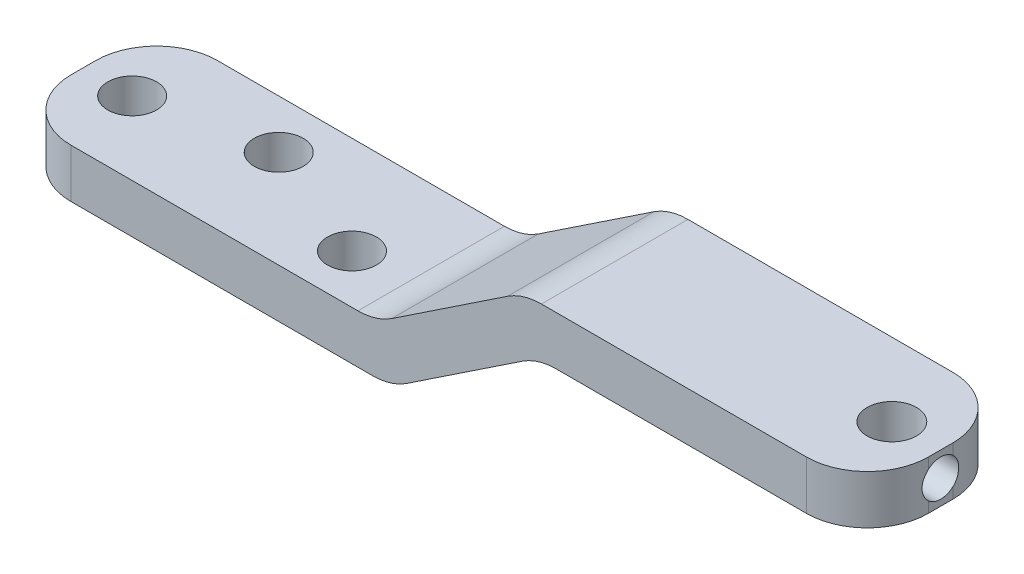
ISO-10303-21;
HEADER;
FILE_DESCRIPTION(('STEP AP214'),'2;1');
FILE_NAME('part.step','',(''),(''),'','','');
FILE_SCHEMA(('AUTOMOTIVE_DESIGN { 1 0 10303 214 1 1 1 1 }'));
ENDSEC;
DATA;
#1=APPLICATION_CONTEXT('core data for automotive mechanical design processes');
#2=APPLICATION_PROTOCOL_DEFINITION('international standard','automotive_design',2000,#1);
#3=PRODUCT_CONTEXT('',#1,'mechanical');
#4=PRODUCT('Part','Part','',(#3));
#5=PRODUCT_RELATED_PRODUCT_CATEGORY('part','',(#4));
#6=PRODUCT_DEFINITION_FORMATION('','',#4);
#7=PRODUCT_DEFINITION_CONTEXT('part definition',#1,'design');
#8=PRODUCT_DEFINITION('design','',#6,#7);
#9=PRODUCT_DEFINITION_SHAPE('','',#8);
#10=(LENGTH_UNIT() NAMED_UNIT(*) SI_UNIT(.MILLI.,.METRE.));
#11=(NAMED_UNIT(*) PLANE_ANGLE_UNIT() SI_UNIT($,.RADIAN.));
#12=(NAMED_UNIT(*) SI_UNIT($,.STERADIAN.) SOLID_ANGLE_UNIT());
#13=UNCERTAINTY_MEASURE_WITH_UNIT(LENGTH_MEASURE(1.E-05),#10,'distance_accuracy_value','');
#14=(GEOMETRIC_REPRESENTATION_CONTEXT(3) GLOBAL_UNCERTAINTY_ASSIGNED_CONTEXT((#13)) GLOBAL_UNIT_ASSIGNED_CONTEXT((#10,
#11,#12)) REPRESENTATION_CONTEXT('',''));
#15=CARTESIAN_POINT('',(0.,0.,0.));
#16=DIRECTION('',(0.,0.,1.));
#17=DIRECTION('',(1.,0.,0.));
#18=AXIS2_PLACEMENT_3D('',#15,#16,#17);
#19=CARTESIAN_POINT('',(4.,4.,6.));
#20=DIRECTION('',(-1.,0.,0.));
#21=DIRECTION('',(0.,0.,1.));
#22=AXIS2_PLACEMENT_3D('',#19,#20,#21);
#23=PLANE('',#22);
#24=DIRECTION('',(0.,1.,0.));
#25=VECTOR('',#24,1.);
#26=CARTESIAN_POINT('',(4.,4.,1.));
#27=LINE('',#26,#25);
#28=CARTESIAN_POINT('',(4.,4.,1.));
#29=VERTEX_POINT('',#28);
#30=CARTESIAN_POINT('',(4.,3.11803398874989,1.));
#31=VERTEX_POINT('',#30);
#32=EDGE_CURVE('E168',#29,#31,#27,.F.);
#33=ORIENTED_EDGE('',*,*,#32,.T.);
#34=CARTESIAN_POINT('',(4.,2.,0.));
#35=DIRECTION('',(1.,0.,0.));
#36=DIRECTION('',(0.,0.,-1.));
#37=AXIS2_PLACEMENT_3D('',#34,#35,#36);
#38=CIRCLE('',#37,1.49999999999999);
#39=CARTESIAN_POINT('',(4.,3.11803398874988,-1.));
#40=VERTEX_POINT('',#39);
#41=EDGE_CURVE('E47',#40,#31,#38,.T.);
#42=ORIENTED_EDGE('',*,*,#41,.F.);
#43=DIRECTION('',(0.,1.,0.));
#44=VECTOR('',#43,1.);
#45=CARTESIAN_POINT('',(4.,4.,-1.));
#46=LINE('',#45,#44);
#47=CARTESIAN_POINT('',(4.,4.,-1.));
#48=VERTEX_POINT('',#47);
#49=EDGE_CURVE('E54',#40,#48,#46,.T.);
#50=ORIENTED_EDGE('',*,*,#49,.T.);
#51=DIRECTION('',(0.,0.,-1.));
#52=VECTOR('',#51,1.);
#53=CARTESIAN_POINT('',(4.,4.,6.));
#54=LINE('',#53,#52);
#55=EDGE_CURVE('E249',#29,#48,#54,.T.);
#56=ORIENTED_EDGE('',*,*,#55,.F.);
#57=EDGE_LOOP('',(#33,#42,#50,#56));
#58=FACE_BOUND('',#57,.T.);
#59=ADVANCED_FACE('F31',(#58),#23,.F.);
#60=CARTESIAN_POINT('',(4.,0.,-1.));
#61=VERTEX_POINT('',#60);
#62=CARTESIAN_POINT('',(4.,0.881966011250122,-1.));
#63=VERTEX_POINT('',#62);
#64=EDGE_CURVE('E175',#61,#63,#46,.T.);
#65=ORIENTED_EDGE('',*,*,#64,.T.);
#66=CARTESIAN_POINT('',(4.,0.881966011250122,1.));
#67=VERTEX_POINT('',#66);
#68=EDGE_CURVE('E159',#67,#63,#38,.T.);
#69=ORIENTED_EDGE('',*,*,#68,.F.);
#70=CARTESIAN_POINT('',(4.,0.,1.));
#71=VERTEX_POINT('',#70);
#72=EDGE_CURVE('E178',#67,#71,#27,.F.);
#73=ORIENTED_EDGE('',*,*,#72,.T.);
#74=DIRECTION('',(0.,0.,-1.));
#75=VECTOR('',#74,1.);
#76=CARTESIAN_POINT('',(4.,0.,6.));
#77=LINE('',#76,#75);
#78=EDGE_CURVE('E232',#71,#61,#77,.T.);
#79=ORIENTED_EDGE('',*,*,#78,.T.);
#80=EDGE_LOOP('',(#65,#69,#73,#79));
#81=FACE_BOUND('',#80,.T.);
#82=ADVANCED_FACE('F231',(#81),#23,.F.);
#83=CARTESIAN_POINT('',(-24.211102550928,4.,6.));
#84=DIRECTION('',(0.,-1.,0.));
#85=DIRECTION('',(1.,0.,0.));
#86=AXIS2_PLACEMENT_3D('',#83,#84,#85);
#87=PLANE('',#86);
#88=CARTESIAN_POINT('',(0.,4.,0.));
#89=DIRECTION('',(0.,1.,0.));
#90=DIRECTION('',(-1.,0.,0.));
#91=AXIS2_PLACEMENT_3D('',#88,#89,#90);
#92=CIRCLE('',#91,2.025);
#93=CARTESIAN_POINT('',(-2.025,4.,0.));
#94=VERTEX_POINT('',#93);
#95=EDGE_CURVE('E358',#94,#94,#92,.T.);
#96=ORIENTED_EDGE('',*,*,#95,.F.);
#97=EDGE_LOOP('',(#96));
#98=FACE_BOUND('',#97,.T.);
#99=DIRECTION('',(-1.,0.,0.));
#100=VECTOR('',#99,1.);
#101=CARTESIAN_POINT('',(-24.211102550928,4.,-6.));
#102=LINE('',#101,#100);
#103=CARTESIAN_POINT('',(-1.,4.,-6.));
#104=VERTEX_POINT('',#103);
#105=CARTESIAN_POINT('',(-22.697224362268,4.,-6.));
#106=VERTEX_POINT('',#105);
#107=EDGE_CURVE('E205',#104,#106,#102,.T.);
#108=ORIENTED_EDGE('',*,*,#107,.T.);
#109=DIRECTION('',(0.,0.,-1.));
#110=VECTOR('',#109,1.);
#111=CARTESIAN_POINT('',(-22.697224362268,4.,6.));
#112=LINE('',#111,#110);
#113=CARTESIAN_POINT('',(-22.697224362268,4.,6.));
#114=VERTEX_POINT('',#113);
#115=EDGE_CURVE('E217',#106,#114,#112,.F.);
#116=ORIENTED_EDGE('',*,*,#115,.T.);
#117=DIRECTION('',(-1.,0.,0.));
#118=VECTOR('',#117,1.);
#119=CARTESIAN_POINT('',(-24.211102550928,4.,6.));
#120=LINE('',#119,#118);
#121=CARTESIAN_POINT('',(-1.,4.,6.));
#122=VERTEX_POINT('',#121);
#123=EDGE_CURVE('E306',#122,#114,#120,.T.);
#124=ORIENTED_EDGE('',*,*,#123,.F.);
#125=CARTESIAN_POINT('',(-1.,4.,1.));
#126=DIRECTION('',(0.,-1.,0.));
#127=DIRECTION('',(1.,0.,0.));
#128=AXIS2_PLACEMENT_3D('',#125,#126,#127);
#129=CIRCLE('',#128,5.);
#130=EDGE_CURVE('E209',#122,#29,#129,.F.);
#131=ORIENTED_EDGE('',*,*,#130,.T.);
#132=ORIENTED_EDGE('',*,*,#55,.T.);
#133=CARTESIAN_POINT('',(-1.,4.,-1.));
#134=DIRECTION('',(0.,-1.,0.));
#135=DIRECTION('',(1.,0.,0.));
#136=AXIS2_PLACEMENT_3D('',#133,#134,#135);
#137=CIRCLE('',#136,5.);
#138=EDGE_CURVE('E173',#48,#104,#137,.F.);
#139=ORIENTED_EDGE('',*,*,#138,.T.);
#140=EDGE_LOOP('',(#108,#116,#124,#131,#132,#139));
#141=FACE_BOUND('',#140,.T.);
#142=ADVANCED_FACE('F351',(#98,#141),#87,.F.);
#143=CARTESIAN_POINT('',(-36.211102550928,-4.00000000000001,6.));
#144=DIRECTION('',(0.554700196225229,-0.832050294337843,0.));
#145=DIRECTION('',(0.832050294337843,0.554700196225229,0.));
#146=AXIS2_PLACEMENT_3D('',#143,#144,#145);
#147=PLANE('',#146);
#148=DIRECTION('',(-0.832050294337843,-0.55470019622523,0.));
#149=VECTOR('',#148,1.);
#150=CARTESIAN_POINT('',(-36.211102550928,-4.00000000000001,-6.));
#151=LINE('',#150,#149);
#152=CARTESIAN_POINT('',(-25.4707253433942,3.16025147168922,-6.));
#153=VERTEX_POINT('',#152);
#154=CARTESIAN_POINT('',(-34.9514797584618,-3.16025147168922,-6.));
#155=VERTEX_POINT('',#154);
#156=EDGE_CURVE('E190',#153,#155,#151,.T.);
#157=ORIENTED_EDGE('',*,*,#156,.T.);
#158=DIRECTION('',(0.,0.,-1.));
#159=VECTOR('',#158,1.);
#160=CARTESIAN_POINT('',(-34.9514797584618,-3.16025147168922,6.));
#161=LINE('',#160,#159);
#162=CARTESIAN_POINT('',(-34.9514797584618,-3.16025147168922,6.));
#163=VERTEX_POINT('',#162);
#164=EDGE_CURVE('E201',#155,#163,#161,.F.);
#165=ORIENTED_EDGE('',*,*,#164,.T.);
#166=DIRECTION('',(-0.832050294337843,-0.55470019622523,0.));
#167=VECTOR('',#166,1.);
#168=CARTESIAN_POINT('',(-36.211102550928,-4.00000000000001,6.));
#169=LINE('',#168,#167);
#170=CARTESIAN_POINT('',(-25.4707253433942,3.16025147168922,6.));
#171=VERTEX_POINT('',#170);
#172=EDGE_CURVE('E301',#171,#163,#169,.T.);
#173=ORIENTED_EDGE('',*,*,#172,.F.);
#174=DIRECTION('',(0.,0.,-1.));
#175=VECTOR('',#174,1.);
#176=CARTESIAN_POINT('',(-25.4707253433942,3.16025147168921,6.));
#177=LINE('',#176,#175);
#178=EDGE_CURVE('E204',#171,#153,#177,.T.);
#179=ORIENTED_EDGE('',*,*,#178,.T.);
#180=EDGE_LOOP('',(#157,#165,#173,#179));
#181=FACE_BOUND('',#180,.T.);
#182=ADVANCED_FACE('F199',(#181),#147,.F.);
#183=CARTESIAN_POINT('',(-66.211102550928,-4.00000000000001,6.));
#184=DIRECTION('',(0.,-1.,0.));
#185=DIRECTION('',(0.,0.,-1.));
#186=AXIS2_PLACEMENT_3D('',#183,#184,#185);
#187=PLANE('',#186);
#188=CARTESIAN_POINT('',(-42.211102550928,-4.00000000000001,2.));
#189=DIRECTION('',(0.,1.,0.));
#190=DIRECTION('',(0.,0.,1.));
#191=AXIS2_PLACEMENT_3D('',#188,#189,#190);
#192=CIRCLE('',#191,2.);
#193=CARTESIAN_POINT('',(-42.211102550928,-4.00000000000001,4.));
#194=VERTEX_POINT('',#193);
#195=EDGE_CURVE('E163',#194,#194,#192,.T.);
#196=ORIENTED_EDGE('',*,*,#195,.F.);
#197=EDGE_LOOP('',(#196));
#198=FACE_BOUND('',#197,.T.);
#199=CARTESIAN_POINT('',(-52.211102550928,-4.00000000000001,-2.));
#200=DIRECTION('',(0.,1.,0.));
#201=DIRECTION('',(0.,0.,1.));
#202=AXIS2_PLACEMENT_3D('',#199,#200,#201);
#203=CIRCLE('',#202,2.);
#204=CARTESIAN_POINT('',(-52.211102550928,-4.00000000000001,0.));
#205=VERTEX_POINT('',#204);
#206=EDGE_CURVE('E368',#205,#205,#203,.T.);
#207=ORIENTED_EDGE('',*,*,#206,.F.);
#208=EDGE_LOOP('',(#207));
#209=FACE_BOUND('',#208,.T.);
#210=CARTESIAN_POINT('',(-62.211102550928,-4.00000000000001,0.));
#211=DIRECTION('',(0.,1.,0.));
#212=DIRECTION('',(0.,0.,1.));
#213=AXIS2_PLACEMENT_3D('',#210,#211,#212);
#214=CIRCLE('',#213,2.);
#215=CARTESIAN_POINT('',(-62.211102550928,-4.00000000000001,2.));
#216=VERTEX_POINT('',#215);
#217=EDGE_CURVE('E362',#216,#216,#214,.T.);
#218=ORIENTED_EDGE('',*,*,#217,.F.);
#219=EDGE_LOOP('',(#218));
#220=FACE_BOUND('',#219,.T.);
#221=DIRECTION('',(-1.,0.,0.));
#222=VECTOR('',#221,1.);
#223=CARTESIAN_POINT('',(-66.211102550928,-4.00000000000001,6.));
#224=LINE('',#223,#222);
#225=CARTESIAN_POINT('',(-37.7249807395879,-4.00000000000001,6.));
#226=VERTEX_POINT('',#225);
#227=CARTESIAN_POINT('',(-61.211102550928,-4.00000000000001,6.));
#228=VERTEX_POINT('',#227);
#229=EDGE_CURVE('E295',#226,#228,#224,.T.);
#230=ORIENTED_EDGE('',*,*,#229,.F.);
#231=DIRECTION('',(0.,0.,-1.));
#232=VECTOR('',#231,1.);
#233=CARTESIAN_POINT('',(-37.7249807395879,-4.00000000000001,-6.));
#234=LINE('',#233,#232);
#235=CARTESIAN_POINT('',(-37.7249807395879,-4.00000000000001,-6.));
#236=VERTEX_POINT('',#235);
#237=EDGE_CURVE('E212',#226,#236,#234,.T.);
#238=ORIENTED_EDGE('',*,*,#237,.T.);
#239=DIRECTION('',(-1.,0.,0.));
#240=VECTOR('',#239,1.);
#241=CARTESIAN_POINT('',(-66.211102550928,-4.00000000000001,-6.));
#242=LINE('',#241,#240);
#243=CARTESIAN_POINT('',(-61.211102550928,-4.00000000000001,-6.));
#244=VERTEX_POINT('',#243);
#245=EDGE_CURVE('E192',#236,#244,#242,.T.);
#246=ORIENTED_EDGE('',*,*,#245,.T.);
#247=CARTESIAN_POINT('',(-61.211102550928,-4.00000000000001,-1.));
#248=DIRECTION('',(0.,-1.,0.));
#249=DIRECTION('',(0.,0.,-1.));
#250=AXIS2_PLACEMENT_3D('',#247,#248,#249);
#251=CIRCLE('',#250,5.);
#252=CARTESIAN_POINT('',(-66.211102550928,-4.00000000000001,-1.));
#253=VERTEX_POINT('',#252);
#254=EDGE_CURVE('E289',#244,#253,#251,.F.);
#255=ORIENTED_EDGE('',*,*,#254,.T.);
#256=DIRECTION('',(0.,0.,-1.));
#257=VECTOR('',#256,1.);
#258=CARTESIAN_POINT('',(-66.211102550928,-4.00000000000001,6.));
#259=LINE('',#258,#257);
#260=CARTESIAN_POINT('',(-66.211102550928,-4.00000000000001,1.));
#261=VERTEX_POINT('',#260);
#262=EDGE_CURVE('E253',#261,#253,#259,.T.);
#263=ORIENTED_EDGE('',*,*,#262,.F.);
#264=CARTESIAN_POINT('',(-61.211102550928,-4.00000000000001,1.));
#265=DIRECTION('',(0.,-1.,0.));
#266=DIRECTION('',(0.,0.,-1.));
#267=AXIS2_PLACEMENT_3D('',#264,#265,#266);
#268=CIRCLE('',#267,5.);
#269=EDGE_CURVE('E287',#261,#228,#268,.F.);
#270=ORIENTED_EDGE('',*,*,#269,.T.);
#271=EDGE_LOOP('',(#230,#238,#246,#255,#263,#270));
#272=FACE_BOUND('',#271,.T.);
#273=ADVANCED_FACE('F292',(#198,#209,#220,#272),#187,.F.);
#274=CARTESIAN_POINT('',(-66.211102550928,-8.00000000000001,6.));
#275=DIRECTION('',(1.,0.,0.));
#276=DIRECTION('',(0.,0.,-1.));
#277=AXIS2_PLACEMENT_3D('',#274,#275,#276);
#278=PLANE('',#277);
#279=ORIENTED_EDGE('',*,*,#262,.T.);
#280=DIRECTION('',(0.,-1.,0.));
#281=VECTOR('',#280,1.);
#282=CARTESIAN_POINT('',(-66.211102550928,-8.00000000000001,-1.));
#283=LINE('',#282,#281);
#284=CARTESIAN_POINT('',(-66.211102550928,-8.00000000000001,-1.));
#285=VERTEX_POINT('',#284);
#286=EDGE_CURVE('E220',#253,#285,#283,.T.);
#287=ORIENTED_EDGE('',*,*,#286,.T.);
#288=DIRECTION('',(0.,0.,-1.));
#289=VECTOR('',#288,1.);
#290=CARTESIAN_POINT('',(-66.211102550928,-8.00000000000001,6.));
#291=LINE('',#290,#289);
#292=CARTESIAN_POINT('',(-66.211102550928,-8.00000000000001,1.));
#293=VERTEX_POINT('',#292);
#294=EDGE_CURVE('E243',#293,#285,#291,.T.);
#295=ORIENTED_EDGE('',*,*,#294,.F.);
#296=DIRECTION('',(0.,-1.,0.));
#297=VECTOR('',#296,1.);
#298=CARTESIAN_POINT('',(-66.211102550928,-8.00000000000001,1.));
#299=LINE('',#298,#297);
#300=EDGE_CURVE('E219',#293,#261,#299,.F.);
#301=ORIENTED_EDGE('',*,*,#300,.T.);
#302=EDGE_LOOP('',(#279,#287,#295,#301));
#303=FACE_BOUND('',#302,.T.);
#304=ADVANCED_FACE('F325',(#303),#278,.F.);
#305=CARTESIAN_POINT('',(-35.,-8.00000000000001,6.));
#306=DIRECTION('',(0.,1.,0.));
#307=DIRECTION('',(-1.,0.,0.));
#308=AXIS2_PLACEMENT_3D('',#305,#306,#307);
#309=PLANE('',#308);
#310=CARTESIAN_POINT('',(-42.211102550928,-8.00000000000001,2.));
#311=DIRECTION('',(0.,1.,0.));
#312=DIRECTION('',(0.,0.,1.));
#313=AXIS2_PLACEMENT_3D('',#310,#311,#312);
#314=CIRCLE('',#313,2.);
#315=CARTESIAN_POINT('',(-42.211102550928,-8.00000000000001,4.));
#316=VERTEX_POINT('',#315);
#317=EDGE_CURVE('E371',#316,#316,#314,.T.);
#318=ORIENTED_EDGE('',*,*,#317,.T.);
#319=EDGE_LOOP('',(#318));
#320=FACE_BOUND('',#319,.T.);
#321=CARTESIAN_POINT('',(-52.211102550928,-8.00000000000001,-2.));
#322=DIRECTION('',(0.,1.,0.));
#323=DIRECTION('',(0.,0.,1.));
#324=AXIS2_PLACEMENT_3D('',#321,#322,#323);
#325=CIRCLE('',#324,2.);
#326=CARTESIAN_POINT('',(-52.211102550928,-8.00000000000001,0.));
#327=VERTEX_POINT('',#326);
#328=EDGE_CURVE('E365',#327,#327,#325,.T.);
#329=ORIENTED_EDGE('',*,*,#328,.T.);
#330=EDGE_LOOP('',(#329));
#331=FACE_BOUND('',#330,.T.);
#332=CARTESIAN_POINT('',(-62.211102550928,-8.00000000000001,0.));
#333=DIRECTION('',(0.,1.,0.));
#334=DIRECTION('',(0.,0.,1.));
#335=AXIS2_PLACEMENT_3D('',#332,#333,#334);
#336=CIRCLE('',#335,2.);
#337=CARTESIAN_POINT('',(-62.211102550928,-8.00000000000001,2.));
#338=VERTEX_POINT('',#337);
#339=EDGE_CURVE('E361',#338,#338,#336,.T.);
#340=ORIENTED_EDGE('',*,*,#339,.T.);
#341=EDGE_LOOP('',(#340));
#342=FACE_BOUND('',#341,.T.);
#343=DIRECTION('',(1.,0.,0.));
#344=VECTOR('',#343,1.);
#345=CARTESIAN_POINT('',(-35.,-8.00000000000001,-6.));
#346=LINE('',#345,#344);
#347=CARTESIAN_POINT('',(-61.211102550928,-8.00000000000001,-6.));
#348=VERTEX_POINT('',#347);
#349=CARTESIAN_POINT('',(-36.51387818866,-8.00000000000001,-6.));
#350=VERTEX_POINT('',#349);
#351=EDGE_CURVE('E316',#348,#350,#346,.T.);
#352=ORIENTED_EDGE('',*,*,#351,.T.);
#353=DIRECTION('',(0.,0.,-1.));
#354=VECTOR('',#353,1.);
#355=CARTESIAN_POINT('',(-36.51387818866,-8.00000000000001,6.));
#356=LINE('',#355,#354);
#357=CARTESIAN_POINT('',(-36.51387818866,-8.00000000000001,6.));
#358=VERTEX_POINT('',#357);
#359=EDGE_CURVE('E277',#350,#358,#356,.F.);
#360=ORIENTED_EDGE('',*,*,#359,.T.);
#361=DIRECTION('',(1.,0.,0.));
#362=VECTOR('',#361,1.);
#363=CARTESIAN_POINT('',(-35.,-8.00000000000001,6.));
#364=LINE('',#363,#362);
#365=CARTESIAN_POINT('',(-61.211102550928,-8.00000000000001,6.));
#366=VERTEX_POINT('',#365);
#367=EDGE_CURVE('E300',#366,#358,#364,.T.);
#368=ORIENTED_EDGE('',*,*,#367,.F.);
#369=CARTESIAN_POINT('',(-61.211102550928,-8.00000000000001,1.));
#370=DIRECTION('',(0.,1.,0.));
#371=DIRECTION('',(-1.,0.,0.));
#372=AXIS2_PLACEMENT_3D('',#369,#370,#371);
#373=CIRCLE('',#372,5.);
#374=EDGE_CURVE('E273',#366,#293,#373,.F.);
#375=ORIENTED_EDGE('',*,*,#374,.T.);
#376=ORIENTED_EDGE('',*,*,#294,.T.);
#377=CARTESIAN_POINT('',(-61.211102550928,-8.00000000000001,-1.));
#378=DIRECTION('',(0.,1.,0.));
#379=DIRECTION('',(-1.,0.,0.));
#380=AXIS2_PLACEMENT_3D('',#377,#378,#379);
#381=CIRCLE('',#380,5.);
#382=EDGE_CURVE('E275',#285,#348,#381,.F.);
#383=ORIENTED_EDGE('',*,*,#382,.T.);
#384=EDGE_LOOP('',(#352,#360,#368,#375,#376,#383));
#385=FACE_BOUND('',#384,.T.);
#386=ADVANCED_FACE('F332',(#320,#331,#342,#385),#309,.F.);
#387=CARTESIAN_POINT('',(-23.,0.,6.));
#388=DIRECTION('',(-0.55470019622523,0.832050294337843,0.));
#389=DIRECTION('',(-0.832050294337843,-0.55470019622523,0.));
#390=AXIS2_PLACEMENT_3D('',#387,#388,#389);
#391=PLANE('',#390);
#392=DIRECTION('',(0.832050294337843,0.55470019622523,0.));
#393=VECTOR('',#392,1.);
#394=CARTESIAN_POINT('',(-23.,0.,-6.));
#395=LINE('',#394,#393);
#396=CARTESIAN_POINT('',(-33.7403772075338,-7.16025147168922,-6.));
#397=VERTEX_POINT('',#396);
#398=CARTESIAN_POINT('',(-24.2596227924662,-0.839748528310786,-6.));
#399=VERTEX_POINT('',#398);
#400=EDGE_CURVE('E319',#397,#399,#395,.T.);
#401=ORIENTED_EDGE('',*,*,#400,.T.);
#402=DIRECTION('',(0.,0.,-1.));
#403=VECTOR('',#402,1.);
#404=CARTESIAN_POINT('',(-24.2596227924662,-0.839748528310786,6.));
#405=LINE('',#404,#403);
#406=CARTESIAN_POINT('',(-24.2596227924662,-0.839748528310786,6.));
#407=VERTEX_POINT('',#406);
#408=EDGE_CURVE('E263',#399,#407,#405,.F.);
#409=ORIENTED_EDGE('',*,*,#408,.T.);
#410=DIRECTION('',(0.832050294337843,0.55470019622523,0.));
#411=VECTOR('',#410,1.);
#412=CARTESIAN_POINT('',(-23.,0.,6.));
#413=LINE('',#412,#411);
#414=CARTESIAN_POINT('',(-33.7403772075338,-7.16025147168922,6.));
#415=VERTEX_POINT('',#414);
#416=EDGE_CURVE('E304',#415,#407,#413,.T.);
#417=ORIENTED_EDGE('',*,*,#416,.F.);
#418=DIRECTION('',(0.,0.,-1.));
#419=VECTOR('',#418,1.);
#420=CARTESIAN_POINT('',(-33.7403772075338,-7.16025147168922,6.));
#421=LINE('',#420,#419);
#422=EDGE_CURVE('E260',#415,#397,#421,.T.);
#423=ORIENTED_EDGE('',*,*,#422,.T.);
#424=EDGE_LOOP('',(#401,#409,#417,#423));
#425=FACE_BOUND('',#424,.T.);
#426=ADVANCED_FACE('F340',(#425),#391,.F.);
#427=CARTESIAN_POINT('',(4.,0.,6.));
#428=DIRECTION('',(0.,1.,0.));
#429=DIRECTION('',(-1.,0.,0.));
#430=AXIS2_PLACEMENT_3D('',#427,#428,#429);
#431=PLANE('',#430);
#432=CARTESIAN_POINT('',(0.,0.,0.));
#433=DIRECTION('',(0.,1.,0.));
#434=DIRECTION('',(-1.,0.,0.));
#435=AXIS2_PLACEMENT_3D('',#432,#433,#434);
#436=CIRCLE('',#435,2.025);
#437=CARTESIAN_POINT('',(-2.025,0.,0.));
#438=VERTEX_POINT('',#437);
#439=EDGE_CURVE('E256',#438,#438,#436,.T.);
#440=ORIENTED_EDGE('',*,*,#439,.T.);
#441=EDGE_LOOP('',(#440));
#442=FACE_BOUND('',#441,.T.);
#443=DIRECTION('',(1.,0.,0.));
#444=VECTOR('',#443,1.);
#445=CARTESIAN_POINT('',(4.,0.,6.));
#446=LINE('',#445,#444);
#447=CARTESIAN_POINT('',(-21.48612181134,0.,6.));
#448=VERTEX_POINT('',#447);
#449=CARTESIAN_POINT('',(-1.,0.,6.));
#450=VERTEX_POINT('',#449);
#451=EDGE_CURVE('E244',#448,#450,#446,.T.);
#452=ORIENTED_EDGE('',*,*,#451,.F.);
#453=DIRECTION('',(0.,0.,-1.));
#454=VECTOR('',#453,1.);
#455=CARTESIAN_POINT('',(-21.48612181134,0.,-6.));
#456=LINE('',#455,#454);
#457=CARTESIAN_POINT('',(-21.48612181134,0.,-6.));
#458=VERTEX_POINT('',#457);
#459=EDGE_CURVE('E251',#448,#458,#456,.T.);
#460=ORIENTED_EDGE('',*,*,#459,.T.);
#461=DIRECTION('',(1.,0.,0.));
#462=VECTOR('',#461,1.);
#463=CARTESIAN_POINT('',(4.,0.,-6.));
#464=LINE('',#463,#462);
#465=CARTESIAN_POINT('',(-1.,0.,-6.));
#466=VERTEX_POINT('',#465);
#467=EDGE_CURVE('E322',#458,#466,#464,.T.);
#468=ORIENTED_EDGE('',*,*,#467,.T.);
#469=CARTESIAN_POINT('',(-1.,0.,-1.));
#470=DIRECTION('',(0.,1.,0.));
#471=DIRECTION('',(-1.,0.,0.));
#472=AXIS2_PLACEMENT_3D('',#469,#470,#471);
#473=CIRCLE('',#472,5.);
#474=EDGE_CURVE('E242',#466,#61,#473,.F.);
#475=ORIENTED_EDGE('',*,*,#474,.T.);
#476=ORIENTED_EDGE('',*,*,#78,.F.);
#477=CARTESIAN_POINT('',(-1.,0.,1.));
#478=DIRECTION('',(0.,1.,0.));
#479=DIRECTION('',(-1.,0.,0.));
#480=AXIS2_PLACEMENT_3D('',#477,#478,#479);
#481=CIRCLE('',#480,5.);
#482=EDGE_CURVE('E238',#71,#450,#481,.F.);
#483=ORIENTED_EDGE('',*,*,#482,.T.);
#484=EDGE_LOOP('',(#452,#460,#468,#475,#476,#483));
#485=FACE_BOUND('',#484,.T.);
#486=ADVANCED_FACE('F237',(#442,#485),#431,.F.);
#487=CARTESIAN_POINT('',(4.,0.,6.));
#488=DIRECTION('',(0.,0.,-1.));
#489=DIRECTION('',(-1.,0.,0.));
#490=AXIS2_PLACEMENT_3D('',#487,#488,#489);
#491=PLANE('',#490);
#492=ORIENTED_EDGE('',*,*,#367,.T.);
#493=CARTESIAN_POINT('',(-36.51387818866,-3.00000000000001,6.));
#494=DIRECTION('',(0.,0.,-1.));
#495=DIRECTION('',(-1.,0.,0.));
#496=AXIS2_PLACEMENT_3D('',#493,#494,#495);
#497=CIRCLE('',#496,5.);
#498=EDGE_CURVE('E285',#358,#415,#497,.F.);
#499=ORIENTED_EDGE('',*,*,#498,.T.);
#500=ORIENTED_EDGE('',*,*,#416,.T.);
#501=CARTESIAN_POINT('',(-21.48612181134,-5.,6.));
#502=DIRECTION('',(0.,0.,-1.));
#503=DIRECTION('',(-1.,0.,0.));
#504=AXIS2_PLACEMENT_3D('',#501,#502,#503);
#505=CIRCLE('',#504,5.);
#506=EDGE_CURVE('E183',#407,#448,#505,.T.);
#507=ORIENTED_EDGE('',*,*,#506,.T.);
#508=ORIENTED_EDGE('',*,*,#451,.T.);
#509=DIRECTION('',(0.,1.,0.));
#510=VECTOR('',#509,1.);
#511=CARTESIAN_POINT('',(-1.,0.,6.));
#512=LINE('',#511,#510);
#513=EDGE_CURVE('E248',#450,#122,#512,.T.);
#514=ORIENTED_EDGE('',*,*,#513,.T.);
#515=ORIENTED_EDGE('',*,*,#123,.T.);
#516=CARTESIAN_POINT('',(-22.697224362268,-1.,6.));
#517=DIRECTION('',(0.,0.,-1.));
#518=DIRECTION('',(-1.,0.,0.));
#519=AXIS2_PLACEMENT_3D('',#516,#517,#518);
#520=CIRCLE('',#519,5.);
#521=EDGE_CURVE('E283',#114,#171,#520,.F.);
#522=ORIENTED_EDGE('',*,*,#521,.T.);
#523=ORIENTED_EDGE('',*,*,#172,.T.);
#524=CARTESIAN_POINT('',(-37.7249807395879,0.99999999999999,6.));
#525=DIRECTION('',(0.,0.,-1.));
#526=DIRECTION('',(-1.,0.,0.));
#527=AXIS2_PLACEMENT_3D('',#524,#525,#526);
#528=CIRCLE('',#527,5.);
#529=EDGE_CURVE('E11',#163,#226,#528,.T.);
#530=ORIENTED_EDGE('',*,*,#529,.T.);
#531=ORIENTED_EDGE('',*,*,#229,.T.);
#532=DIRECTION('',(0.,-1.,0.));
#533=VECTOR('',#532,1.);
#534=CARTESIAN_POINT('',(-61.211102550928,0.,6.));
#535=LINE('',#534,#533);
#536=EDGE_CURVE('E280',#228,#366,#535,.T.);
#537=ORIENTED_EDGE('',*,*,#536,.T.);
#538=EDGE_LOOP('',(#492,#499,#500,#507,#508,#514,#515,#522,#523,#530,#531,#537));
#539=FACE_BOUND('',#538,.T.);
#540=ADVANCED_FACE('F343',(#539),#491,.F.);
#541=CARTESIAN_POINT('',(4.,0.,-6.));
#542=DIRECTION('',(0.,0.,-1.));
#543=DIRECTION('',(-1.,0.,0.));
#544=AXIS2_PLACEMENT_3D('',#541,#542,#543);
#545=PLANE('',#544);
#546=ORIENTED_EDGE('',*,*,#400,.F.);
#547=CARTESIAN_POINT('',(-36.51387818866,-3.00000000000001,-6.));
#548=DIRECTION('',(0.,0.,-1.));
#549=DIRECTION('',(-1.,0.,0.));
#550=AXIS2_PLACEMENT_3D('',#547,#548,#549);
#551=CIRCLE('',#550,5.);
#552=EDGE_CURVE('E271',#397,#350,#551,.T.);
#553=ORIENTED_EDGE('',*,*,#552,.T.);
#554=ORIENTED_EDGE('',*,*,#351,.F.);
#555=DIRECTION('',(0.,-1.,0.));
#556=VECTOR('',#555,1.);
#557=CARTESIAN_POINT('',(-61.211102550928,-4.00000000000001,-6.));
#558=LINE('',#557,#556);
#559=EDGE_CURVE('E267',#348,#244,#558,.F.);
#560=ORIENTED_EDGE('',*,*,#559,.T.);
#561=ORIENTED_EDGE('',*,*,#245,.F.);
#562=CARTESIAN_POINT('',(-37.7249807395879,0.99999999999999,-6.));
#563=DIRECTION('',(0.,0.,-1.));
#564=DIRECTION('',(-1.,0.,0.));
#565=AXIS2_PLACEMENT_3D('',#562,#563,#564);
#566=CIRCLE('',#565,5.);
#567=EDGE_CURVE('E40',#236,#155,#566,.F.);
#568=ORIENTED_EDGE('',*,*,#567,.T.);
#569=ORIENTED_EDGE('',*,*,#156,.F.);
#570=CARTESIAN_POINT('',(-22.697224362268,-1.,-6.));
#571=DIRECTION('',(0.,0.,-1.));
#572=DIRECTION('',(-1.,0.,0.));
#573=AXIS2_PLACEMENT_3D('',#570,#571,#572);
#574=CIRCLE('',#573,5.);
#575=EDGE_CURVE('E269',#153,#106,#574,.T.);
#576=ORIENTED_EDGE('',*,*,#575,.T.);
#577=ORIENTED_EDGE('',*,*,#107,.F.);
#578=DIRECTION('',(0.,1.,0.));
#579=VECTOR('',#578,1.);
#580=CARTESIAN_POINT('',(-1.,0.,-6.));
#581=LINE('',#580,#579);
#582=EDGE_CURVE('E265',#104,#466,#581,.F.);
#583=ORIENTED_EDGE('',*,*,#582,.T.);
#584=ORIENTED_EDGE('',*,*,#467,.F.);
#585=CARTESIAN_POINT('',(-21.48612181134,-5.,-6.));
#586=DIRECTION('',(0.,0.,-1.));
#587=DIRECTION('',(-1.,0.,0.));
#588=AXIS2_PLACEMENT_3D('',#585,#586,#587);
#589=CIRCLE('',#588,5.);
#590=EDGE_CURVE('E177',#458,#399,#589,.F.);
#591=ORIENTED_EDGE('',*,*,#590,.T.);
#592=EDGE_LOOP('',(#546,#553,#554,#560,#561,#568,#569,#576,#577,#583,#584,#591));
#593=FACE_BOUND('',#592,.T.);
#594=ADVANCED_FACE('F189',(#593),#545,.T.);
#595=CARTESIAN_POINT('',(0.,-8.00000000000001,0.));
#596=DIRECTION('',(0.,1.,0.));
#597=DIRECTION('',(-1.,0.,0.));
#598=AXIS2_PLACEMENT_3D('',#595,#596,#597);
#599=CYLINDRICAL_SURFACE('',#598,2.025);
#600=CARTESIAN_POINT('',(1.36037678604129,2.,-1.49999999999999));
#601=CARTESIAN_POINT('',(1.36038944530825,2.07038824511991,-1.49999379904754));
#602=CARTESIAN_POINT('',(1.36596432702745,2.14081299106828,-1.49498917127013));
#603=CARTESIAN_POINT('',(1.38696918828383,2.27888123183427,-1.4755085887214));
#604=CARTESIAN_POINT('',(1.40242649228251,2.34651646007039,-1.46100637081657));
#605=CARTESIAN_POINT('',(1.44005251372399,2.47639735863413,-1.42392229819442));
#606=CARTESIAN_POINT('',(1.4621299977991,2.53870236076068,-1.40144956143932));
#607=CARTESIAN_POINT('',(1.51035888707434,2.65845684764736,-1.34933393226198));
#608=CARTESIAN_POINT('',(1.53650998535711,2.71590669770548,-1.31969157992549));
#609=CARTESIAN_POINT('',(1.59622589708248,2.83703567714187,-1.24712342813861));
#610=CARTESIAN_POINT('',(1.63021957289791,2.89962012988126,-1.20272322965181));
#611=CARTESIAN_POINT('',(1.69809014871241,3.0174467912118,-1.10484137973255));
#612=CARTESIAN_POINT('',(1.73196681077571,3.07267832211205,-1.05134677273322));
#613=CARTESIAN_POINT('',(1.80355689286804,3.18508355052084,-0.924189205094365));
#614=CARTESIAN_POINT('',(1.84071392155468,3.2405015574419,-0.848628916885063));
#615=CARTESIAN_POINT('',(1.90727870708111,3.33727825823982,-0.68598877574854));
#616=CARTESIAN_POINT('',(1.9367041077166,3.37866902639864,-0.598935844204278));
#617=CARTESIAN_POINT('',(1.97710504970581,3.43477244735116,-0.442872857328313));
#618=CARTESIAN_POINT('',(1.99096304130937,3.45375412682516,-0.376131046933187));
#619=CARTESIAN_POINT('',(2.01194925247983,3.48236692438581,-0.23965559974545));
#620=CARTESIAN_POINT('',(2.01908323488924,3.49200604975187,-0.1699245785632));
#621=CARTESIAN_POINT('',(2.02601591982054,3.50137450929699,-0.0292558921582485));
#622=CARTESIAN_POINT('',(2.02579650030971,3.50107936102686,0.0416843234151822));
#623=CARTESIAN_POINT('',(2.01799869899551,3.49053886555872,0.182414733573472));
#624=CARTESIAN_POINT('',(2.01041853380994,3.48029110701417,0.252204645292131));
#625=CARTESIAN_POINT('',(1.98891178118915,3.45094466434072,0.386435696193786));
#626=CARTESIAN_POINT('',(1.97519647696054,3.43214030972219,0.450976587194177));
#627=CARTESIAN_POINT('',(1.94248960606617,3.38668289242606,0.575783246980377));
#628=CARTESIAN_POINT('',(1.92349692090558,3.36002816585878,0.636048106095788));
#629=CARTESIAN_POINT('',(1.87911063715023,3.29653544666268,0.75776711520135));
#630=CARTESIAN_POINT('',(1.85324431151957,3.25890284743252,0.818631284517068));
#631=CARTESIAN_POINT('',(1.79814561982182,3.17628676136005,0.933467908638078));
#632=CARTESIAN_POINT('',(1.76891023182202,3.13129665969511,0.987434083234539));
#633=CARTESIAN_POINT('',(1.70297225856939,3.02544297044188,1.09790981081785));
#634=CARTESIAN_POINT('',(1.66592083455234,2.9631929681877,1.1528841090154));
#635=CARTESIAN_POINT('',(1.59268486636908,2.83013107445409,1.25210838179919));
#636=CARTESIAN_POINT('',(1.55650062205793,2.75931627117554,1.29635469371435));
#637=CARTESIAN_POINT('',(1.4960930228035,2.624888433452,1.36527651599803));
#638=CARTESIAN_POINT('',(1.47094197834807,2.56280243019364,1.39210630759751));
#639=CARTESIAN_POINT('',(1.42656768879547,2.43372272267207,1.43754697663581));
#640=CARTESIAN_POINT('',(1.40733107918752,2.36674051274402,1.45617642569447));
#641=CARTESIAN_POINT('',(1.3805653974564,2.24155485330744,1.48153437413789));
#642=CARTESIAN_POINT('',(1.37153523093134,2.18399764877003,1.48981994843688));
#643=CARTESIAN_POINT('',(1.36083143241841,2.06765213499281,1.49960682027497));
#644=CARTESIAN_POINT('',(1.35914973577269,2.00886524654002,1.50111555518069));
#645=CARTESIAN_POINT('',(1.36341533120673,1.89183449694469,1.49724057073329));
#646=CARTESIAN_POINT('',(1.36936007701128,1.83359046109602,1.49185915182851));
#647=CARTESIAN_POINT('',(1.38791317084167,1.71913354297548,1.47461084109594));
#648=CARTESIAN_POINT('',(1.40053235721519,1.66292412371568,1.46273339957474));
#649=CARTESIAN_POINT('',(1.43667970883759,1.53228033693765,1.427385977138));
#650=CARTESIAN_POINT('',(1.46254084490006,1.4592373584032,1.40120610506819));
#651=CARTESIAN_POINT('',(1.51964626544024,1.31972207900947,1.33906031222062));
#652=CARTESIAN_POINT('',(1.55090137122113,1.25326341773674,1.3030746334963));
#653=CARTESIAN_POINT('',(1.61650668083987,1.12501636269836,1.22081709891347));
#654=CARTESIAN_POINT('',(1.65092552387788,1.06345927490437,1.17424080911628));
#655=CARTESIAN_POINT('',(1.71905570553441,0.948005210393325,1.07202865633061));
#656=CARTESIAN_POINT('',(1.75276743481443,0.894103903690576,1.01639795288861));
#657=CARTESIAN_POINT('',(1.81704831402691,0.794817454277729,0.896431239761138));
#658=CARTESIAN_POINT('',(1.8476200229057,0.749425351728747,0.832102419222083));
#659=CARTESIAN_POINT('',(1.9033039995655,0.668534558625014,0.695336288479654));
#660=CARTESIAN_POINT('',(1.92842115634171,0.633027000292672,0.622906328420969));
#661=CARTESIAN_POINT('',(1.9677271055869,0.578159259830071,0.482838387378929));
#662=CARTESIAN_POINT('',(1.98299720542974,0.557164225627034,0.416148082588472));
#663=CARTESIAN_POINT('',(2.00683684908896,0.524569888524244,0.279354779860205));
#664=CARTESIAN_POINT('',(2.01541079364985,0.512964414581048,0.2092540555054));
#665=CARTESIAN_POINT('',(2.02513070756937,0.499816874731927,0.0673764011534705));
#666=CARTESIAN_POINT('',(2.02625432388275,0.498305092598917,-0.00440492520328602));
#667=CARTESIAN_POINT('',(2.02090846107871,0.50552625262776,-0.147164835829112));
#668=CARTESIAN_POINT('',(2.01443804843675,0.514260454315596,-0.218143320322809));
#669=CARTESIAN_POINT('',(1.99495179204023,0.540793501643125,-0.353960477594213));
#670=CARTESIAN_POINT('',(1.98225003881838,0.558157846601957,-0.418931428320099));
#671=CARTESIAN_POINT('',(1.95141312843651,0.600855368270359,-0.544808209048246));
#672=CARTESIAN_POINT('',(1.93327682267636,0.626190229616044,-0.605713176368633));
#673=CARTESIAN_POINT('',(1.89072838527434,0.686707202466391,-0.728273754917344));
#674=CARTESIAN_POINT('',(1.86587504271215,0.722611676347759,-0.789416511184486));
#675=CARTESIAN_POINT('',(1.81261501746268,0.801749189507803,-0.905048268194021));
#676=CARTESIAN_POINT('',(1.784205585457,0.844987908394735,-0.959532055568706));
#677=CARTESIAN_POINT('',(1.71987016919284,0.946823249141118,-1.07125050637775));
#678=CARTESIAN_POINT('',(1.68354546820024,1.00677565013961,-1.12702004147375));
#679=CARTESIAN_POINT('',(1.61118076804786,1.13507446742315,-1.22824619017343));
#680=CARTESIAN_POINT('',(1.57514096479639,1.20342620168952,-1.27369621765867));
#681=CARTESIAN_POINT('',(1.51272023005532,1.33626606604746,-1.34693096821533));
#682=CARTESIAN_POINT('',(1.4857259433447,1.39953774941881,-1.3763920925676));
#683=CARTESIAN_POINT('',(1.43750434210635,1.5314555066405,-1.42668205605905));
#684=CARTESIAN_POINT('',(1.41626349610585,1.60008847232493,-1.44753121138644));
#685=CARTESIAN_POINT('',(1.38713211473652,1.72401949492326,-1.4753958894326));
#686=CARTESIAN_POINT('',(1.37723005408111,1.7783501153268,-1.48456862363852));
#687=CARTESIAN_POINT('',(1.36385075475441,1.88844723049171,-1.49686995485227));
#688=CARTESIAN_POINT('',(1.36036675264331,1.94421215083645,-1.50000491470982));
#689=CARTESIAN_POINT('',(1.36037678604129,2.,-1.49999999999999));
#690=B_SPLINE_CURVE_WITH_KNOTS('',3,(#600,#601,#602,#603,#604,#605,#606,#607,#608,#609,#610,
#611,#612,#613,#614,#615,#616,#617,#618,#619,#620,#621,#622,#623,#624,#625,#626,#627,#628,#629,
#630,#631,#632,#633,#634,#635,#636,#637,#638,#639,#640,#641,#642,#643,#644,#645,#646,#647,#648,
#649,#650,#651,#652,#653,#654,#655,#656,#657,#658,#659,#660,#661,#662,#663,#664,#665,#666,#667,
#668,#669,#670,#671,#672,#673,#674,#675,#676,#677,#678,#679,#680,#681,#682,#683,#684,#685,#686,
#687,#688,#689),.UNSPECIFIED.,.T.,.F.,(4,2,2,2,2,2,2,2,2,2,2,2,2,2,2,2,2,2,2,2,2,2,2,2,2,2,2,2,
2,2,2,2,2,2,2,2,2,2,2,2,2,2,2,2,4),(0.,0.210882104736643,0.42234982579048,0.631027675025802,
0.839689809492118,1.09060973418078,1.34189015244741,1.64260705037445,1.94263162361556,
2.15401302787334,2.36521310156401,2.57693370377858,2.7887056150589,2.99368732276057,
3.19871250772627,3.42614722990701,3.65378756476191,3.92556040442815,4.19742590055755,
4.41321912988412,4.62852109777222,4.80429192633385,4.97986980477038,5.15538907747111,
5.33119424768519,5.57521651826478,5.81973415789358,6.0724503407704,6.32502301739999,
6.57738819999773,6.82952624172918,7.04330075571536,7.25693465758978,7.47120923135621,
7.68551014838865,7.88997395350691,8.09448100284702,8.31905690313219,8.54380751472215,
8.81152184250685,9.07940655370004,9.3031898029487,9.5264420758178,9.69375803878912,
9.86089758077228),.UNSPECIFIED.);
#691=CARTESIAN_POINT('',(1.36037678604129,2.,-1.49999999999999));
#692=VERTEX_POINT('',#691);
#693=EDGE_CURVE('E169',#692,#692,#690,.T.);
#694=ORIENTED_EDGE('',*,*,#693,.T.);
#695=EDGE_LOOP('',(#694));
#696=FACE_BOUND('',#695,.T.);
#697=ORIENTED_EDGE('',*,*,#95,.T.);
#698=EDGE_LOOP('',(#697));
#699=FACE_BOUND('',#698,.T.);
#700=ORIENTED_EDGE('',*,*,#439,.F.);
#701=EDGE_LOOP('',(#700));
#702=FACE_BOUND('',#701,.T.);
#703=ADVANCED_FACE('F400',(#696,#699,#702),#599,.F.);
#704=CARTESIAN_POINT('',(-62.211102550928,-8.00000000000001,0.));
#705=DIRECTION('',(0.,1.,0.));
#706=DIRECTION('',(0.,0.,1.));
#707=AXIS2_PLACEMENT_3D('',#704,#705,#706);
#708=CYLINDRICAL_SURFACE('',#707,2.);
#709=ORIENTED_EDGE('',*,*,#339,.F.);
#710=EDGE_LOOP('',(#709));
#711=FACE_BOUND('',#710,.T.);
#712=ORIENTED_EDGE('',*,*,#217,.T.);
#713=EDGE_LOOP('',(#712));
#714=FACE_BOUND('',#713,.T.);
#715=ADVANCED_FACE('F403',(#711,#714),#708,.F.);
#716=CARTESIAN_POINT('',(-52.211102550928,-8.00000000000001,-2.));
#717=DIRECTION('',(0.,1.,0.));
#718=DIRECTION('',(0.,0.,1.));
#719=AXIS2_PLACEMENT_3D('',#716,#717,#718);
#720=CYLINDRICAL_SURFACE('',#719,2.);
#721=ORIENTED_EDGE('',*,*,#328,.F.);
#722=EDGE_LOOP('',(#721));
#723=FACE_BOUND('',#722,.T.);
#724=ORIENTED_EDGE('',*,*,#206,.T.);
#725=EDGE_LOOP('',(#724));
#726=FACE_BOUND('',#725,.T.);
#727=ADVANCED_FACE('F505',(#723,#726),#720,.F.);
#728=CARTESIAN_POINT('',(-42.211102550928,-8.00000000000001,2.));
#729=DIRECTION('',(0.,1.,0.));
#730=DIRECTION('',(0.,0.,1.));
#731=AXIS2_PLACEMENT_3D('',#728,#729,#730);
#732=CYLINDRICAL_SURFACE('',#731,2.);
#733=ORIENTED_EDGE('',*,*,#317,.F.);
#734=EDGE_LOOP('',(#733));
#735=FACE_BOUND('',#734,.T.);
#736=ORIENTED_EDGE('',*,*,#195,.T.);
#737=EDGE_LOOP('',(#736));
#738=FACE_BOUND('',#737,.T.);
#739=ADVANCED_FACE('F429',(#735,#738),#732,.F.);
#740=CARTESIAN_POINT('',(-21.48612181134,-5.,6.));
#741=DIRECTION('',(0.,0.,1.));
#742=DIRECTION('',(1.,0.,0.));
#743=AXIS2_PLACEMENT_3D('',#740,#741,#742);
#744=CYLINDRICAL_SURFACE('',#743,5.);
#745=ORIENTED_EDGE('',*,*,#506,.F.);
#746=ORIENTED_EDGE('',*,*,#408,.F.);
#747=ORIENTED_EDGE('',*,*,#590,.F.);
#748=ORIENTED_EDGE('',*,*,#459,.F.);
#749=EDGE_LOOP('',(#745,#746,#747,#748));
#750=FACE_BOUND('',#749,.T.);
#751=ADVANCED_FACE('F346',(#750),#744,.F.);
#752=CARTESIAN_POINT('',(-36.51387818866,-3.00000000000001,6.));
#753=DIRECTION('',(0.,0.,-1.));
#754=DIRECTION('',(-1.,0.,0.));
#755=AXIS2_PLACEMENT_3D('',#752,#753,#754);
#756=CYLINDRICAL_SURFACE('',#755,5.);
#757=ORIENTED_EDGE('',*,*,#498,.F.);
#758=ORIENTED_EDGE('',*,*,#359,.F.);
#759=ORIENTED_EDGE('',*,*,#552,.F.);
#760=ORIENTED_EDGE('',*,*,#422,.F.);
#761=EDGE_LOOP('',(#757,#758,#759,#760));
#762=FACE_BOUND('',#761,.T.);
#763=ADVANCED_FACE('F337',(#762),#756,.T.);
#764=CARTESIAN_POINT('',(-37.7249807395879,0.99999999999999,6.));
#765=DIRECTION('',(0.,0.,1.));
#766=DIRECTION('',(1.,0.,0.));
#767=AXIS2_PLACEMENT_3D('',#764,#765,#766);
#768=CYLINDRICAL_SURFACE('',#767,5.);
#769=ORIENTED_EDGE('',*,*,#529,.F.);
#770=ORIENTED_EDGE('',*,*,#164,.F.);
#771=ORIENTED_EDGE('',*,*,#567,.F.);
#772=ORIENTED_EDGE('',*,*,#237,.F.);
#773=EDGE_LOOP('',(#769,#770,#771,#772));
#774=FACE_BOUND('',#773,.T.);
#775=ADVANCED_FACE('F208',(#774),#768,.F.);
#776=CARTESIAN_POINT('',(-22.697224362268,-1.,6.));
#777=DIRECTION('',(0.,0.,-1.));
#778=DIRECTION('',(-1.,0.,0.));
#779=AXIS2_PLACEMENT_3D('',#776,#777,#778);
#780=CYLINDRICAL_SURFACE('',#779,5.);
#781=ORIENTED_EDGE('',*,*,#521,.F.);
#782=ORIENTED_EDGE('',*,*,#115,.F.);
#783=ORIENTED_EDGE('',*,*,#575,.F.);
#784=ORIENTED_EDGE('',*,*,#178,.F.);
#785=EDGE_LOOP('',(#781,#782,#783,#784));
#786=FACE_BOUND('',#785,.T.);
#787=ADVANCED_FACE('F356',(#786),#780,.T.);
#788=CARTESIAN_POINT('',(-61.211102550928,-8.00000000000001,-1.));
#789=DIRECTION('',(0.,1.,0.));
#790=DIRECTION('',(0.,0.,1.));
#791=AXIS2_PLACEMENT_3D('',#788,#789,#790);
#792=CYLINDRICAL_SURFACE('',#791,5.);
#793=ORIENTED_EDGE('',*,*,#254,.F.);
#794=ORIENTED_EDGE('',*,*,#559,.F.);
#795=ORIENTED_EDGE('',*,*,#382,.F.);
#796=ORIENTED_EDGE('',*,*,#286,.F.);
#797=EDGE_LOOP('',(#793,#794,#795,#796));
#798=FACE_BOUND('',#797,.T.);
#799=ADVANCED_FACE('F328',(#798),#792,.T.);
#800=CARTESIAN_POINT('',(-61.211102550928,0.,1.));
#801=DIRECTION('',(0.,-1.,0.));
#802=DIRECTION('',(0.,0.,-1.));
#803=AXIS2_PLACEMENT_3D('',#800,#801,#802);
#804=CYLINDRICAL_SURFACE('',#803,5.);
#805=ORIENTED_EDGE('',*,*,#269,.F.);
#806=ORIENTED_EDGE('',*,*,#300,.F.);
#807=ORIENTED_EDGE('',*,*,#374,.F.);
#808=ORIENTED_EDGE('',*,*,#536,.F.);
#809=EDGE_LOOP('',(#805,#806,#807,#808));
#810=FACE_BOUND('',#809,.T.);
#811=ADVANCED_FACE('F437',(#810),#804,.T.);
#812=CARTESIAN_POINT('',(-1.,4.,-1.));
#813=DIRECTION('',(0.,-1.,0.));
#814=DIRECTION('',(0.,0.,-1.));
#815=AXIS2_PLACEMENT_3D('',#812,#813,#814);
#816=CYLINDRICAL_SURFACE('',#815,5.);
#817=CARTESIAN_POINT('',(4.,0.881966011250114,-1.));
#818=CARTESIAN_POINT('',(4.00000021973064,0.910061676637902,-1.03141180200663));
#819=CARTESIAN_POINT('',(3.99970399477921,0.939467264341028,-1.06162265984099));
#820=CARTESIAN_POINT('',(3.99865635198913,1.00070626921413,-1.11945847752319));
#821=CARTESIAN_POINT('',(3.9979049881344,1.03253939806277,-1.14708374359878));
#822=CARTESIAN_POINT('',(3.99517759619464,1.13129248772989,-1.22572826493368));
#823=CARTESIAN_POINT('',(3.99272734672132,1.20156132067454,-1.27262241284006));
#824=CARTESIAN_POINT('',(3.98762296300987,1.34893680173542,-1.35396174009788));
#825=CARTESIAN_POINT('',(3.98496877635534,1.4260452085666,-1.38840370589505));
#826=CARTESIAN_POINT('',(3.98033534742557,1.58496071656879,-1.44389054459977));
#827=CARTESIAN_POINT('',(3.97835600782947,1.66676713824108,-1.46493734962639));
#828=CARTESIAN_POINT('',(3.97565156826002,1.83290181110758,-1.49304656858534));
#829=CARTESIAN_POINT('',(3.97492845514921,1.9172338429708,-1.50008683215575));
#830=CARTESIAN_POINT('',(3.97494607862043,2.08588275792048,-1.49991154897712));
#831=CARTESIAN_POINT('',(3.9756868079351,2.17019964108007,-1.49269607300188));
#832=CARTESIAN_POINT('',(3.9784174125758,2.33603558317305,-1.46428313633744));
#833=CARTESIAN_POINT('',(3.98040172253437,2.41756540969126,-1.44314794887335));
#834=CARTESIAN_POINT('',(3.98503397939673,2.57593317723582,-1.38756937348258));
#835=CARTESIAN_POINT('',(3.98768201341363,2.65277050072831,-1.35312423831718));
#836=CARTESIAN_POINT('',(3.99276774308478,2.79960162500778,-1.27187389954352));
#837=CARTESIAN_POINT('',(3.99520557217855,2.86959977116547,-1.22507661495022));
#838=CARTESIAN_POINT('',(3.99791781495409,2.96798610028839,-1.14663521961891));
#839=CARTESIAN_POINT('',(3.99866470596882,2.99970332765823,-1.1190875154016));
#840=CARTESIAN_POINT('',(3.99970593355977,3.0607256871158,-1.06142441410431));
#841=CARTESIAN_POINT('',(4.00000021672336,3.0900305341303,-1.03130871441554));
#842=CARTESIAN_POINT('',(4.,3.11803398874989,-1.));
#843=B_SPLINE_CURVE_WITH_KNOTS('',3,(#817,#818,#819,#820,#821,#822,#823,#824,#825,#826,#827,
#828,#829,#830,#831,#832,#833,#834,#835,#836,#837,#838,#839,#840,#841,#842),.UNSPECIFIED.,.F.,
.F.,(4,2,2,2,2,2,2,2,2,2,2,2,4),(0.,0.126349375947688,0.252683768564339,0.504930290336406,
0.757241863376875,1.00951703472274,1.26219084541523,1.51486340169085,1.76641317492643,
2.01799598111657,2.26941788662458,2.39533827882673,2.52127352986144),.UNSPECIFIED.);
#844=EDGE_CURVE('E155',#63,#40,#843,.T.);
#845=ORIENTED_EDGE('',*,*,#844,.F.);
#846=ORIENTED_EDGE('',*,*,#64,.F.);
#847=ORIENTED_EDGE('',*,*,#474,.F.);
#848=ORIENTED_EDGE('',*,*,#582,.F.);
#849=ORIENTED_EDGE('',*,*,#138,.F.);
#850=ORIENTED_EDGE('',*,*,#49,.F.);
#851=EDGE_LOOP('',(#845,#846,#847,#848,#849,#850));
#852=FACE_BOUND('',#851,.T.);
#853=ADVANCED_FACE('F171',(#852),#816,.T.);
#854=CARTESIAN_POINT('',(-1.,0.,1.));
#855=DIRECTION('',(0.,1.,0.));
#856=DIRECTION('',(0.,0.,1.));
#857=AXIS2_PLACEMENT_3D('',#854,#855,#856);
#858=CYLINDRICAL_SURFACE('',#857,5.);
#859=CARTESIAN_POINT('',(4.,3.11803398874989,1.));
#860=CARTESIAN_POINT('',(4.00000021973064,3.0899383233621,1.03141180200663));
#861=CARTESIAN_POINT('',(3.99970399477921,3.06053273565897,1.06162265984099));
#862=CARTESIAN_POINT('',(3.99865635198913,2.99929373078587,1.11945847752319));
#863=CARTESIAN_POINT('',(3.9979049881344,2.96746060193723,1.14708374359878));
#864=CARTESIAN_POINT('',(3.99517759619464,2.86870751227011,1.22572826493368));
#865=CARTESIAN_POINT('',(3.99272734672132,2.79843867932546,1.27262241284006));
#866=CARTESIAN_POINT('',(3.98762296300987,2.65106319826458,1.35396174009788));
#867=CARTESIAN_POINT('',(3.98496877635534,2.5739547914334,1.38840370589505));
#868=CARTESIAN_POINT('',(3.98033534742557,2.41503928343121,1.44389054459977));
#869=CARTESIAN_POINT('',(3.97835600782947,2.33323286175892,1.46493734962639));
#870=CARTESIAN_POINT('',(3.97565156826002,2.16709818889242,1.49304656858534));
#871=CARTESIAN_POINT('',(3.97492845514921,2.0827661570292,1.50008683215575));
#872=CARTESIAN_POINT('',(3.97494607862043,1.91411724207952,1.49991154897712));
#873=CARTESIAN_POINT('',(3.9756868079351,1.82980035891993,1.49269607300188));
#874=CARTESIAN_POINT('',(3.9784174125758,1.66396441682695,1.46428313633744));
#875=CARTESIAN_POINT('',(3.98040172253437,1.58243459030874,1.44314794887335));
#876=CARTESIAN_POINT('',(3.98503397939673,1.42406682276418,1.38756937348258));
#877=CARTESIAN_POINT('',(3.98768201341363,1.34722949927169,1.35312423831718));
#878=CARTESIAN_POINT('',(3.99276774308478,1.20039837499222,1.27187389954352));
#879=CARTESIAN_POINT('',(3.99520557217855,1.13040022883453,1.22507661495022));
#880=CARTESIAN_POINT('',(3.99791781495409,1.03201389971161,1.14663521961891));
#881=CARTESIAN_POINT('',(3.99866470596882,1.00029667234177,1.1190875154016));
#882=CARTESIAN_POINT('',(3.99970593355977,0.939274312884202,1.06142441410431));
#883=CARTESIAN_POINT('',(4.00000021672336,0.909969465869697,1.03130871441554));
#884=CARTESIAN_POINT('',(4.,0.881966011250114,1.));
#885=B_SPLINE_CURVE_WITH_KNOTS('',3,(#859,#860,#861,#862,#863,#864,#865,#866,#867,#868,#869,
#870,#871,#872,#873,#874,#875,#876,#877,#878,#879,#880,#881,#882,#883,#884),.UNSPECIFIED.,.F.,
.F.,(4,2,2,2,2,2,2,2,2,2,2,2,4),(0.,0.126349375947689,0.252683768564339,0.504930290336407,
0.757241863376876,1.00951703472274,1.26219084541523,1.51486340169085,1.76641317492643,
2.01799598111657,2.26941788662458,2.39533827882673,2.52127352986144),.UNSPECIFIED.);
#886=EDGE_CURVE('E164',#31,#67,#885,.T.);
#887=ORIENTED_EDGE('',*,*,#886,.F.);
#888=ORIENTED_EDGE('',*,*,#32,.F.);
#889=ORIENTED_EDGE('',*,*,#130,.F.);
#890=ORIENTED_EDGE('',*,*,#513,.F.);
#891=ORIENTED_EDGE('',*,*,#482,.F.);
#892=ORIENTED_EDGE('',*,*,#72,.F.);
#893=EDGE_LOOP('',(#887,#888,#889,#890,#891,#892));
#894=FACE_BOUND('',#893,.T.);
#895=ADVANCED_FACE('F33',(#894),#858,.T.);
#896=CARTESIAN_POINT('',(4.,2.,0.));
#897=DIRECTION('',(1.,0.,0.));
#898=DIRECTION('',(0.,0.,-1.));
#899=AXIS2_PLACEMENT_3D('',#896,#897,#898);
#900=CYLINDRICAL_SURFACE('',#899,1.49999999999999);
#901=ORIENTED_EDGE('',*,*,#844,.T.);
#902=ORIENTED_EDGE('',*,*,#41,.T.);
#903=ORIENTED_EDGE('',*,*,#886,.T.);
#904=ORIENTED_EDGE('',*,*,#68,.T.);
#905=EDGE_LOOP('',(#901,#902,#903,#904));
#906=FACE_BOUND('',#905,.T.);
#907=ORIENTED_EDGE('',*,*,#693,.F.);
#908=EDGE_LOOP('',(#907));
#909=FACE_BOUND('',#908,.T.);
#910=ADVANCED_FACE('F156',(#906,#909),#900,.F.);
#911=CLOSED_SHELL('',(#59,#82,#142,#182,#273,#304,#386,#426,#486,#540,#594,#703,#715,#727,#739,
#751,#763,#775,#787,#799,#811,#853,#895,#910));
#912=MANIFOLD_SOLID_BREP('B2',#911);
#913=ADVANCED_BREP_SHAPE_REPRESENTATION('',(#18,#912),#14);
#914=SHAPE_DEFINITION_REPRESENTATION(#9,#913);
ENDSEC;
END-ISO-10303-21;
